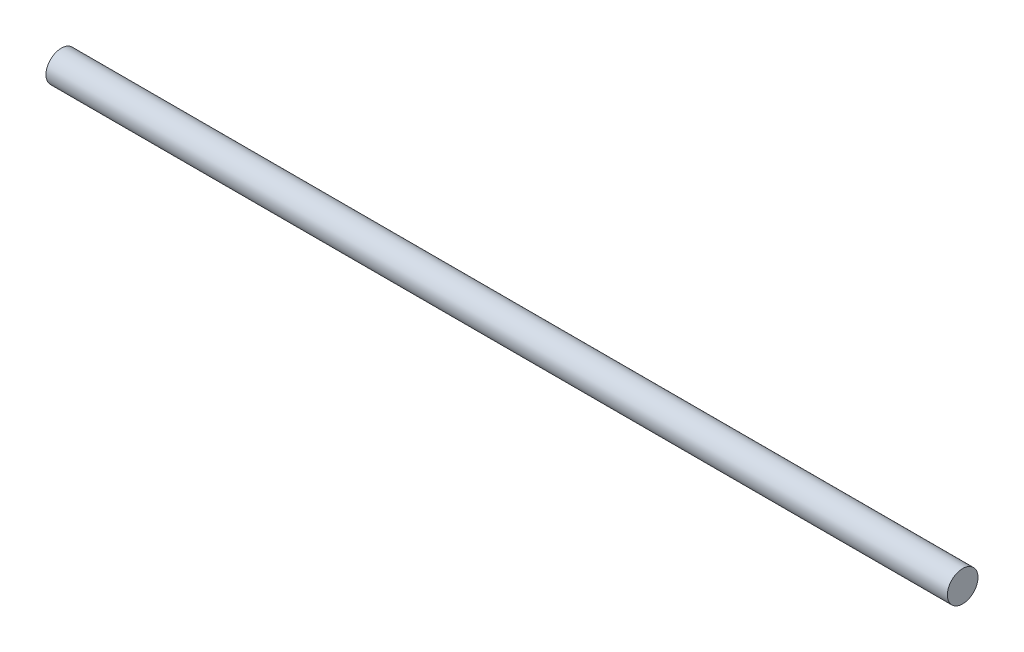
ISO-10303-21;
HEADER;
FILE_DESCRIPTION(('STEP AP214'),'2;1');
FILE_NAME('part.step','',(''),(''),'','','');
FILE_SCHEMA(('AUTOMOTIVE_DESIGN { 1 0 10303 214 1 1 1 1 }'));
ENDSEC;
DATA;
#1=APPLICATION_CONTEXT('core data for automotive mechanical design processes');
#2=APPLICATION_PROTOCOL_DEFINITION('international standard','automotive_design',2000,#1);
#3=PRODUCT_CONTEXT('',#1,'mechanical');
#4=PRODUCT('Part','Part','',(#3));
#5=PRODUCT_RELATED_PRODUCT_CATEGORY('part','',(#4));
#6=PRODUCT_DEFINITION_FORMATION('','',#4);
#7=PRODUCT_DEFINITION_CONTEXT('part definition',#1,'design');
#8=PRODUCT_DEFINITION('design','',#6,#7);
#9=PRODUCT_DEFINITION_SHAPE('','',#8);
#10=(LENGTH_UNIT() NAMED_UNIT(*) SI_UNIT(.MILLI.,.METRE.));
#11=(NAMED_UNIT(*) PLANE_ANGLE_UNIT() SI_UNIT($,.RADIAN.));
#12=(NAMED_UNIT(*) SI_UNIT($,.STERADIAN.) SOLID_ANGLE_UNIT());
#13=UNCERTAINTY_MEASURE_WITH_UNIT(LENGTH_MEASURE(1.E-05),#10,'distance_accuracy_value','');
#14=(GEOMETRIC_REPRESENTATION_CONTEXT(3) GLOBAL_UNCERTAINTY_ASSIGNED_CONTEXT((#13)) GLOBAL_UNIT_ASSIGNED_CONTEXT((#10,
#11,#12)) REPRESENTATION_CONTEXT('',''));
#15=CARTESIAN_POINT('',(0.,0.,0.));
#16=DIRECTION('',(0.,0.,1.));
#17=DIRECTION('',(1.,0.,0.));
#18=AXIS2_PLACEMENT_3D('',#15,#16,#17);
#19=CARTESIAN_POINT('',(25.,0.,0.));
#20=DIRECTION('',(-1.,0.,0.));
#21=DIRECTION('',(0.,0.,1.));
#22=AXIS2_PLACEMENT_3D('',#19,#20,#21);
#23=CYLINDRICAL_SURFACE('',#22,0.85);
#24=CARTESIAN_POINT('',(25.,0.,0.));
#25=DIRECTION('',(1.,0.,0.));
#26=DIRECTION('',(0.,0.,-1.));
#27=AXIS2_PLACEMENT_3D('',#24,#25,#26);
#28=CIRCLE('',#27,0.85);
#29=CARTESIAN_POINT('',(25.,0.,-0.85));
#30=VERTEX_POINT('',#29);
#31=EDGE_CURVE('E10',#30,#30,#28,.T.);
#32=ORIENTED_EDGE('',*,*,#31,.F.);
#33=EDGE_LOOP('',(#32));
#34=FACE_BOUND('',#33,.T.);
#35=CARTESIAN_POINT('',(-25.,0.,0.));
#36=DIRECTION('',(1.,0.,0.));
#37=DIRECTION('',(0.,0.,-1.));
#38=AXIS2_PLACEMENT_3D('',#35,#36,#37);
#39=CIRCLE('',#38,0.85);
#40=CARTESIAN_POINT('',(-25.,0.,-0.85));
#41=VERTEX_POINT('',#40);
#42=EDGE_CURVE('E44',#41,#41,#39,.T.);
#43=ORIENTED_EDGE('',*,*,#42,.T.);
#44=EDGE_LOOP('',(#43));
#45=FACE_BOUND('',#44,.T.);
#46=ADVANCED_FACE('F41',(#34,#45),#23,.T.);
#47=CARTESIAN_POINT('',(25.,0.,0.));
#48=DIRECTION('',(1.,0.,0.));
#49=DIRECTION('',(0.,0.,-1.));
#50=AXIS2_PLACEMENT_3D('',#47,#48,#49);
#51=PLANE('',#50);
#52=ORIENTED_EDGE('',*,*,#31,.T.);
#53=EDGE_LOOP('',(#52));
#54=FACE_BOUND('',#53,.T.);
#55=ADVANCED_FACE('F58',(#54),#51,.T.);
#56=CARTESIAN_POINT('',(-25.,0.,0.));
#57=DIRECTION('',(1.,0.,0.));
#58=DIRECTION('',(0.,0.,-1.));
#59=AXIS2_PLACEMENT_3D('',#56,#57,#58);
#60=PLANE('',#59);
#61=ORIENTED_EDGE('',*,*,#42,.F.);
#62=EDGE_LOOP('',(#61));
#63=FACE_BOUND('',#62,.T.);
#64=ADVANCED_FACE('F56',(#63),#60,.F.);
#65=CLOSED_SHELL('',(#46,#55,#64));
#66=MANIFOLD_SOLID_BREP('B2',#65);
#67=ADVANCED_BREP_SHAPE_REPRESENTATION('',(#18,#66),#14);
#68=SHAPE_DEFINITION_REPRESENTATION(#9,#67);
ENDSEC;
END-ISO-10303-21;
